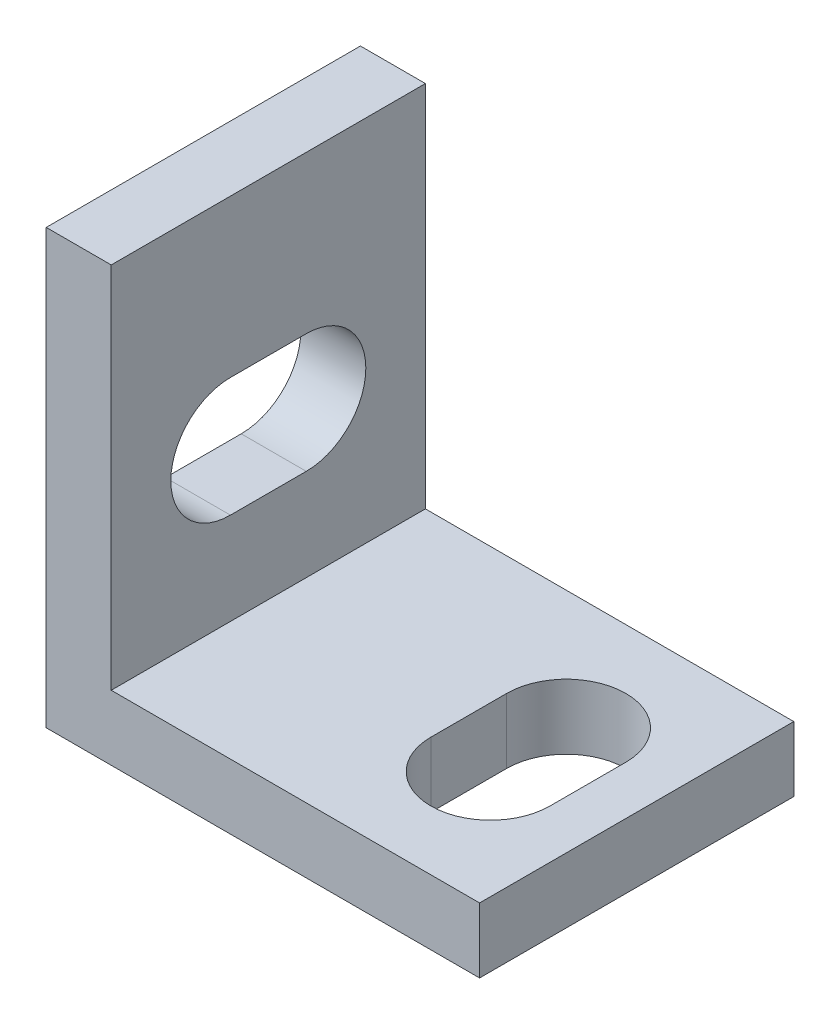
ISO-10303-21;
HEADER;
FILE_DESCRIPTION(('STEP AP214'),'2;1');
FILE_NAME('part.step','',(''),(''),'','','');
FILE_SCHEMA(('AUTOMOTIVE_DESIGN { 1 0 10303 214 1 1 1 1 }'));
ENDSEC;
DATA;
#1=APPLICATION_CONTEXT('core data for automotive mechanical design processes');
#2=APPLICATION_PROTOCOL_DEFINITION('international standard','automotive_design',2000,#1);
#3=PRODUCT_CONTEXT('',#1,'mechanical');
#4=PRODUCT('Part','Part','',(#3));
#5=PRODUCT_RELATED_PRODUCT_CATEGORY('part','',(#4));
#6=PRODUCT_DEFINITION_FORMATION('','',#4);
#7=PRODUCT_DEFINITION_CONTEXT('part definition',#1,'design');
#8=PRODUCT_DEFINITION('design','',#6,#7);
#9=PRODUCT_DEFINITION_SHAPE('','',#8);
#10=(LENGTH_UNIT() NAMED_UNIT(*) SI_UNIT(.MILLI.,.METRE.));
#11=(NAMED_UNIT(*) PLANE_ANGLE_UNIT() SI_UNIT($,.RADIAN.));
#12=(NAMED_UNIT(*) SI_UNIT($,.STERADIAN.) SOLID_ANGLE_UNIT());
#13=UNCERTAINTY_MEASURE_WITH_UNIT(LENGTH_MEASURE(1.E-05),#10,'distance_accuracy_value','');
#14=(GEOMETRIC_REPRESENTATION_CONTEXT(3) GLOBAL_UNCERTAINTY_ASSIGNED_CONTEXT((#13)) GLOBAL_UNIT_ASSIGNED_CONTEXT((#10,
#11,#12)) REPRESENTATION_CONTEXT('',''));
#15=CARTESIAN_POINT('',(0.,0.,0.));
#16=DIRECTION('',(0.,0.,1.));
#17=DIRECTION('',(1.,0.,0.));
#18=AXIS2_PLACEMENT_3D('',#15,#16,#17);
#19=CARTESIAN_POINT('',(0.,0.,14.5));
#20=DIRECTION('',(0.,1.,0.));
#21=DIRECTION('',(0.,0.,1.));
#22=AXIS2_PLACEMENT_3D('',#19,#20,#21);
#23=PLANE('',#22);
#24=DIRECTION('',(0.,0.,1.));
#25=VECTOR('',#24,1.);
#26=CARTESIAN_POINT('',(12.25,0.,9.));
#27=LINE('',#26,#25);
#28=CARTESIAN_POINT('',(12.25,0.,5.5));
#29=VERTEX_POINT('',#28);
#30=CARTESIAN_POINT('',(12.25,0.,9.));
#31=VERTEX_POINT('',#30);
#32=EDGE_CURVE('E141',#29,#31,#27,.T.);
#33=ORIENTED_EDGE('',*,*,#32,.T.);
#34=CARTESIAN_POINT('',(15.,0.,9.));
#35=DIRECTION('',(0.,1.,0.));
#36=DIRECTION('',(0.,0.,1.));
#37=AXIS2_PLACEMENT_3D('',#34,#35,#36);
#38=CIRCLE('',#37,2.75);
#39=CARTESIAN_POINT('',(17.75,0.,9.));
#40=VERTEX_POINT('',#39);
#41=EDGE_CURVE('E135',#31,#40,#38,.T.);
#42=ORIENTED_EDGE('',*,*,#41,.T.);
#43=DIRECTION('',(0.,0.,-1.));
#44=VECTOR('',#43,1.);
#45=CARTESIAN_POINT('',(17.75,0.,9.));
#46=LINE('',#45,#44);
#47=CARTESIAN_POINT('',(17.75,0.,5.5));
#48=VERTEX_POINT('',#47);
#49=EDGE_CURVE('E144',#40,#48,#46,.T.);
#50=ORIENTED_EDGE('',*,*,#49,.T.);
#51=CARTESIAN_POINT('',(15.,0.,5.5));
#52=DIRECTION('',(0.,1.,0.));
#53=DIRECTION('',(0.,0.,1.));
#54=AXIS2_PLACEMENT_3D('',#51,#52,#53);
#55=CIRCLE('',#54,2.75);
#56=EDGE_CURVE('E48',#48,#29,#55,.T.);
#57=ORIENTED_EDGE('',*,*,#56,.T.);
#58=EDGE_LOOP('',(#33,#42,#50,#57));
#59=FACE_BOUND('',#58,.T.);
#60=DIRECTION('',(1.,0.,0.));
#61=VECTOR('',#60,1.);
#62=CARTESIAN_POINT('',(0.,0.,0.));
#63=LINE('',#62,#61);
#64=CARTESIAN_POINT('',(0.,0.,0.));
#65=VERTEX_POINT('',#64);
#66=CARTESIAN_POINT('',(20.,0.,0.));
#67=VERTEX_POINT('',#66);
#68=EDGE_CURVE('E194',#65,#67,#63,.T.);
#69=ORIENTED_EDGE('',*,*,#68,.T.);
#70=DIRECTION('',(0.,0.,-1.));
#71=VECTOR('',#70,1.);
#72=CARTESIAN_POINT('',(20.,0.,14.5));
#73=LINE('',#72,#71);
#74=CARTESIAN_POINT('',(20.,0.,14.5));
#75=VERTEX_POINT('',#74);
#76=EDGE_CURVE('E11',#75,#67,#73,.T.);
#77=ORIENTED_EDGE('',*,*,#76,.F.);
#78=DIRECTION('',(1.,0.,0.));
#79=VECTOR('',#78,1.);
#80=CARTESIAN_POINT('',(0.,0.,14.5));
#81=LINE('',#80,#79);
#82=CARTESIAN_POINT('',(0.,0.,14.5));
#83=VERTEX_POINT('',#82);
#84=EDGE_CURVE('E201',#83,#75,#81,.T.);
#85=ORIENTED_EDGE('',*,*,#84,.F.);
#86=DIRECTION('',(0.,0.,-1.));
#87=VECTOR('',#86,1.);
#88=CARTESIAN_POINT('',(0.,0.,14.5));
#89=LINE('',#88,#87);
#90=EDGE_CURVE('E218',#83,#65,#89,.T.);
#91=ORIENTED_EDGE('',*,*,#90,.T.);
#92=EDGE_LOOP('',(#69,#77,#85,#91));
#93=FACE_BOUND('',#92,.T.);
#94=ADVANCED_FACE('F34',(#59,#93),#23,.F.);
#95=CARTESIAN_POINT('',(20.,3.,14.5));
#96=DIRECTION('',(1.,0.,0.));
#97=DIRECTION('',(0.,0.,-1.));
#98=AXIS2_PLACEMENT_3D('',#95,#96,#97);
#99=PLANE('',#98);
#100=DIRECTION('',(0.,-1.,0.));
#101=VECTOR('',#100,1.);
#102=CARTESIAN_POINT('',(20.,3.,0.));
#103=LINE('',#102,#101);
#104=CARTESIAN_POINT('',(20.,3.,0.));
#105=VERTEX_POINT('',#104);
#106=EDGE_CURVE('E221',#105,#67,#103,.T.);
#107=ORIENTED_EDGE('',*,*,#106,.F.);
#108=DIRECTION('',(0.,0.,-1.));
#109=VECTOR('',#108,1.);
#110=CARTESIAN_POINT('',(20.,3.,14.5));
#111=LINE('',#110,#109);
#112=CARTESIAN_POINT('',(20.,3.,14.5));
#113=VERTEX_POINT('',#112);
#114=EDGE_CURVE('E41',#113,#105,#111,.T.);
#115=ORIENTED_EDGE('',*,*,#114,.F.);
#116=DIRECTION('',(0.,-1.,0.));
#117=VECTOR('',#116,1.);
#118=CARTESIAN_POINT('',(20.,3.,14.5));
#119=LINE('',#118,#117);
#120=EDGE_CURVE('E203',#113,#75,#119,.T.);
#121=ORIENTED_EDGE('',*,*,#120,.T.);
#122=ORIENTED_EDGE('',*,*,#76,.T.);
#123=EDGE_LOOP('',(#107,#115,#121,#122));
#124=FACE_BOUND('',#123,.T.);
#125=ADVANCED_FACE('F248',(#124),#99,.T.);
#126=CARTESIAN_POINT('',(0.,3.,14.5));
#127=DIRECTION('',(0.,1.,0.));
#128=DIRECTION('',(0.,0.,1.));
#129=AXIS2_PLACEMENT_3D('',#126,#127,#128);
#130=PLANE('',#129);
#131=CARTESIAN_POINT('',(15.,3.,9.));
#132=DIRECTION('',(0.,1.,0.));
#133=DIRECTION('',(0.,0.,1.));
#134=AXIS2_PLACEMENT_3D('',#131,#132,#133);
#135=CIRCLE('',#134,2.75);
#136=CARTESIAN_POINT('',(12.25,3.,9.));
#137=VERTEX_POINT('',#136);
#138=CARTESIAN_POINT('',(17.75,3.,9.));
#139=VERTEX_POINT('',#138);
#140=EDGE_CURVE('E56',#137,#139,#135,.T.);
#141=ORIENTED_EDGE('',*,*,#140,.F.);
#142=DIRECTION('',(0.,0.,1.));
#143=VECTOR('',#142,1.);
#144=CARTESIAN_POINT('',(12.25,3.,9.));
#145=LINE('',#144,#143);
#146=CARTESIAN_POINT('',(12.25,3.,5.5));
#147=VERTEX_POINT('',#146);
#148=EDGE_CURVE('E150',#147,#137,#145,.T.);
#149=ORIENTED_EDGE('',*,*,#148,.F.);
#150=CARTESIAN_POINT('',(15.,3.,5.5));
#151=DIRECTION('',(0.,1.,0.));
#152=DIRECTION('',(0.,0.,1.));
#153=AXIS2_PLACEMENT_3D('',#150,#151,#152);
#154=CIRCLE('',#153,2.75);
#155=CARTESIAN_POINT('',(17.75,3.,5.5));
#156=VERTEX_POINT('',#155);
#157=EDGE_CURVE('E153',#156,#147,#154,.T.);
#158=ORIENTED_EDGE('',*,*,#157,.F.);
#159=DIRECTION('',(0.,0.,-1.));
#160=VECTOR('',#159,1.);
#161=CARTESIAN_POINT('',(17.75,3.,9.));
#162=LINE('',#161,#160);
#163=EDGE_CURVE('E159',#139,#156,#162,.T.);
#164=ORIENTED_EDGE('',*,*,#163,.F.);
#165=EDGE_LOOP('',(#141,#149,#158,#164));
#166=FACE_BOUND('',#165,.T.);
#167=DIRECTION('',(1.,0.,0.));
#168=VECTOR('',#167,1.);
#169=CARTESIAN_POINT('',(0.,3.,0.));
#170=LINE('',#169,#168);
#171=CARTESIAN_POINT('',(3.,3.,0.));
#172=VERTEX_POINT('',#171);
#173=EDGE_CURVE('E224',#172,#105,#170,.T.);
#174=ORIENTED_EDGE('',*,*,#173,.F.);
#175=DIRECTION('',(0.,0.,-1.));
#176=VECTOR('',#175,1.);
#177=CARTESIAN_POINT('',(3.,3.,14.5));
#178=LINE('',#177,#176);
#179=CARTESIAN_POINT('',(3.,3.,14.5));
#180=VERTEX_POINT('',#179);
#181=EDGE_CURVE('E240',#180,#172,#178,.T.);
#182=ORIENTED_EDGE('',*,*,#181,.F.);
#183=DIRECTION('',(1.,0.,0.));
#184=VECTOR('',#183,1.);
#185=CARTESIAN_POINT('',(0.,3.,14.5));
#186=LINE('',#185,#184);
#187=EDGE_CURVE('E207',#180,#113,#186,.T.);
#188=ORIENTED_EDGE('',*,*,#187,.T.);
#189=ORIENTED_EDGE('',*,*,#114,.T.);
#190=EDGE_LOOP('',(#174,#182,#188,#189));
#191=FACE_BOUND('',#190,.T.);
#192=ADVANCED_FACE('F244',(#166,#191),#130,.T.);
#193=CARTESIAN_POINT('',(3.,20.,14.5));
#194=DIRECTION('',(1.,0.,0.));
#195=DIRECTION('',(0.,0.,-1.));
#196=AXIS2_PLACEMENT_3D('',#193,#194,#195);
#197=PLANE('',#196);
#198=CARTESIAN_POINT('',(3.,10.,5.5));
#199=DIRECTION('',(1.,0.,0.));
#200=DIRECTION('',(0.,0.,-1.));
#201=AXIS2_PLACEMENT_3D('',#198,#199,#200);
#202=CIRCLE('',#201,2.75);
#203=CARTESIAN_POINT('',(3.,7.25,5.5));
#204=VERTEX_POINT('',#203);
#205=CARTESIAN_POINT('',(3.,12.75,5.5));
#206=VERTEX_POINT('',#205);
#207=EDGE_CURVE('E165',#204,#206,#202,.T.);
#208=ORIENTED_EDGE('',*,*,#207,.F.);
#209=DIRECTION('',(0.,0.,-1.));
#210=VECTOR('',#209,1.);
#211=CARTESIAN_POINT('',(3.,7.25,5.5));
#212=LINE('',#211,#210);
#213=CARTESIAN_POINT('',(3.,7.25,9.));
#214=VERTEX_POINT('',#213);
#215=EDGE_CURVE('E173',#214,#204,#212,.T.);
#216=ORIENTED_EDGE('',*,*,#215,.F.);
#217=CARTESIAN_POINT('',(3.,10.,9.));
#218=DIRECTION('',(1.,0.,0.));
#219=DIRECTION('',(0.,0.,-1.));
#220=AXIS2_PLACEMENT_3D('',#217,#218,#219);
#221=CIRCLE('',#220,2.75);
#222=CARTESIAN_POINT('',(3.,12.75,9.));
#223=VERTEX_POINT('',#222);
#224=EDGE_CURVE('E187',#223,#214,#221,.T.);
#225=ORIENTED_EDGE('',*,*,#224,.F.);
#226=DIRECTION('',(0.,0.,1.));
#227=VECTOR('',#226,1.);
#228=CARTESIAN_POINT('',(3.,12.75,5.5));
#229=LINE('',#228,#227);
#230=EDGE_CURVE('E184',#206,#223,#229,.T.);
#231=ORIENTED_EDGE('',*,*,#230,.F.);
#232=EDGE_LOOP('',(#208,#216,#225,#231));
#233=FACE_BOUND('',#232,.T.);
#234=DIRECTION('',(0.,1.,0.));
#235=VECTOR('',#234,1.);
#236=CARTESIAN_POINT('',(3.,20.,0.));
#237=LINE('',#236,#235);
#238=CARTESIAN_POINT('',(3.,20.,0.));
#239=VERTEX_POINT('',#238);
#240=EDGE_CURVE('E227',#239,#172,#237,.F.);
#241=ORIENTED_EDGE('',*,*,#240,.F.);
#242=DIRECTION('',(0.,0.,-1.));
#243=VECTOR('',#242,1.);
#244=CARTESIAN_POINT('',(3.,20.,14.5));
#245=LINE('',#244,#243);
#246=CARTESIAN_POINT('',(3.,20.,14.5));
#247=VERTEX_POINT('',#246);
#248=EDGE_CURVE('E238',#247,#239,#245,.T.);
#249=ORIENTED_EDGE('',*,*,#248,.F.);
#250=DIRECTION('',(0.,1.,0.));
#251=VECTOR('',#250,1.);
#252=CARTESIAN_POINT('',(3.,20.,14.5));
#253=LINE('',#252,#251);
#254=EDGE_CURVE('E210',#247,#180,#253,.F.);
#255=ORIENTED_EDGE('',*,*,#254,.T.);
#256=ORIENTED_EDGE('',*,*,#181,.T.);
#257=EDGE_LOOP('',(#241,#249,#255,#256));
#258=FACE_BOUND('',#257,.T.);
#259=ADVANCED_FACE('F257',(#233,#258),#197,.T.);
#260=CARTESIAN_POINT('',(0.,20.,14.5));
#261=DIRECTION('',(0.,1.,0.));
#262=DIRECTION('',(0.,0.,1.));
#263=AXIS2_PLACEMENT_3D('',#260,#261,#262);
#264=PLANE('',#263);
#265=DIRECTION('',(1.,0.,0.));
#266=VECTOR('',#265,1.);
#267=CARTESIAN_POINT('',(0.,20.,0.));
#268=LINE('',#267,#266);
#269=CARTESIAN_POINT('',(0.,20.,0.));
#270=VERTEX_POINT('',#269);
#271=EDGE_CURVE('E230',#270,#239,#268,.T.);
#272=ORIENTED_EDGE('',*,*,#271,.F.);
#273=DIRECTION('',(0.,0.,-1.));
#274=VECTOR('',#273,1.);
#275=CARTESIAN_POINT('',(0.,20.,14.5));
#276=LINE('',#275,#274);
#277=CARTESIAN_POINT('',(0.,20.,14.5));
#278=VERTEX_POINT('',#277);
#279=EDGE_CURVE('E236',#278,#270,#276,.T.);
#280=ORIENTED_EDGE('',*,*,#279,.F.);
#281=DIRECTION('',(1.,0.,0.));
#282=VECTOR('',#281,1.);
#283=CARTESIAN_POINT('',(0.,20.,14.5));
#284=LINE('',#283,#282);
#285=EDGE_CURVE('E213',#278,#247,#284,.T.);
#286=ORIENTED_EDGE('',*,*,#285,.T.);
#287=ORIENTED_EDGE('',*,*,#248,.T.);
#288=EDGE_LOOP('',(#272,#280,#286,#287));
#289=FACE_BOUND('',#288,.T.);
#290=ADVANCED_FACE('F267',(#289),#264,.T.);
#291=CARTESIAN_POINT('',(0.,20.,14.5));
#292=DIRECTION('',(1.,0.,0.));
#293=DIRECTION('',(0.,0.,-1.));
#294=AXIS2_PLACEMENT_3D('',#291,#292,#293);
#295=PLANE('',#294);
#296=DIRECTION('',(0.,0.,-1.));
#297=VECTOR('',#296,1.);
#298=CARTESIAN_POINT('',(0.,7.25,5.5));
#299=LINE('',#298,#297);
#300=CARTESIAN_POINT('',(0.,7.25,9.));
#301=VERTEX_POINT('',#300);
#302=CARTESIAN_POINT('',(0.,7.25,5.5));
#303=VERTEX_POINT('',#302);
#304=EDGE_CURVE('E179',#301,#303,#299,.T.);
#305=ORIENTED_EDGE('',*,*,#304,.T.);
#306=CARTESIAN_POINT('',(0.,10.,5.5));
#307=DIRECTION('',(1.,0.,0.));
#308=DIRECTION('',(0.,0.,-1.));
#309=AXIS2_PLACEMENT_3D('',#306,#307,#308);
#310=CIRCLE('',#309,2.75);
#311=CARTESIAN_POINT('',(0.,12.75,5.5));
#312=VERTEX_POINT('',#311);
#313=EDGE_CURVE('E169',#303,#312,#310,.T.);
#314=ORIENTED_EDGE('',*,*,#313,.T.);
#315=DIRECTION('',(0.,0.,1.));
#316=VECTOR('',#315,1.);
#317=CARTESIAN_POINT('',(0.,12.75,5.5));
#318=LINE('',#317,#316);
#319=CARTESIAN_POINT('',(0.,12.75,9.));
#320=VERTEX_POINT('',#319);
#321=EDGE_CURVE('E172',#312,#320,#318,.T.);
#322=ORIENTED_EDGE('',*,*,#321,.T.);
#323=CARTESIAN_POINT('',(0.,10.,9.));
#324=DIRECTION('',(1.,0.,0.));
#325=DIRECTION('',(0.,0.,-1.));
#326=AXIS2_PLACEMENT_3D('',#323,#324,#325);
#327=CIRCLE('',#326,2.75);
#328=EDGE_CURVE('E176',#320,#301,#327,.T.);
#329=ORIENTED_EDGE('',*,*,#328,.T.);
#330=EDGE_LOOP('',(#305,#314,#322,#329));
#331=FACE_BOUND('',#330,.T.);
#332=DIRECTION('',(0.,-1.,0.));
#333=VECTOR('',#332,1.);
#334=CARTESIAN_POINT('',(0.,20.,0.));
#335=LINE('',#334,#333);
#336=EDGE_CURVE('E204',#270,#65,#335,.T.);
#337=ORIENTED_EDGE('',*,*,#336,.T.);
#338=ORIENTED_EDGE('',*,*,#90,.F.);
#339=DIRECTION('',(0.,-1.,0.));
#340=VECTOR('',#339,1.);
#341=CARTESIAN_POINT('',(0.,20.,14.5));
#342=LINE('',#341,#340);
#343=EDGE_CURVE('E216',#278,#83,#342,.T.);
#344=ORIENTED_EDGE('',*,*,#343,.F.);
#345=ORIENTED_EDGE('',*,*,#279,.T.);
#346=EDGE_LOOP('',(#337,#338,#344,#345));
#347=FACE_BOUND('',#346,.T.);
#348=ADVANCED_FACE('F268',(#331,#347),#295,.F.);
#349=CARTESIAN_POINT('',(0.,0.,14.5));
#350=DIRECTION('',(0.,0.,-1.));
#351=DIRECTION('',(-1.,0.,0.));
#352=AXIS2_PLACEMENT_3D('',#349,#350,#351);
#353=PLANE('',#352);
#354=ORIENTED_EDGE('',*,*,#84,.T.);
#355=ORIENTED_EDGE('',*,*,#120,.F.);
#356=ORIENTED_EDGE('',*,*,#187,.F.);
#357=ORIENTED_EDGE('',*,*,#254,.F.);
#358=ORIENTED_EDGE('',*,*,#285,.F.);
#359=ORIENTED_EDGE('',*,*,#343,.T.);
#360=EDGE_LOOP('',(#354,#355,#356,#357,#358,#359));
#361=FACE_BOUND('',#360,.T.);
#362=ADVANCED_FACE('F260',(#361),#353,.F.);
#363=CARTESIAN_POINT('',(0.,0.,0.));
#364=DIRECTION('',(0.,0.,-1.));
#365=DIRECTION('',(-1.,0.,0.));
#366=AXIS2_PLACEMENT_3D('',#363,#364,#365);
#367=PLANE('',#366);
#368=ORIENTED_EDGE('',*,*,#68,.F.);
#369=ORIENTED_EDGE('',*,*,#336,.F.);
#370=ORIENTED_EDGE('',*,*,#271,.T.);
#371=ORIENTED_EDGE('',*,*,#240,.T.);
#372=ORIENTED_EDGE('',*,*,#173,.T.);
#373=ORIENTED_EDGE('',*,*,#106,.T.);
#374=EDGE_LOOP('',(#368,#369,#370,#371,#372,#373));
#375=FACE_BOUND('',#374,.T.);
#376=ADVANCED_FACE('F252',(#375),#367,.T.);
#377=CARTESIAN_POINT('',(0.,10.,5.5));
#378=DIRECTION('',(1.,0.,0.));
#379=DIRECTION('',(0.,0.,-1.));
#380=AXIS2_PLACEMENT_3D('',#377,#378,#379);
#381=CYLINDRICAL_SURFACE('',#380,2.75);
#382=ORIENTED_EDGE('',*,*,#207,.T.);
#383=DIRECTION('',(1.,0.,0.));
#384=VECTOR('',#383,1.);
#385=CARTESIAN_POINT('',(0.,12.75,5.5));
#386=LINE('',#385,#384);
#387=EDGE_CURVE('E182',#312,#206,#386,.T.);
#388=ORIENTED_EDGE('',*,*,#387,.F.);
#389=ORIENTED_EDGE('',*,*,#313,.F.);
#390=DIRECTION('',(1.,0.,0.));
#391=VECTOR('',#390,1.);
#392=CARTESIAN_POINT('',(0.,7.25,5.5));
#393=LINE('',#392,#391);
#394=EDGE_CURVE('E192',#303,#204,#393,.T.);
#395=ORIENTED_EDGE('',*,*,#394,.T.);
#396=EDGE_LOOP('',(#382,#388,#389,#395));
#397=FACE_BOUND('',#396,.T.);
#398=ADVANCED_FACE('F298',(#397),#381,.F.);
#399=CARTESIAN_POINT('',(0.,7.25,5.5));
#400=DIRECTION('',(0.,-1.,0.));
#401=DIRECTION('',(0.,0.,-1.));
#402=AXIS2_PLACEMENT_3D('',#399,#400,#401);
#403=PLANE('',#402);
#404=ORIENTED_EDGE('',*,*,#215,.T.);
#405=ORIENTED_EDGE('',*,*,#394,.F.);
#406=ORIENTED_EDGE('',*,*,#304,.F.);
#407=DIRECTION('',(1.,0.,0.));
#408=VECTOR('',#407,1.);
#409=CARTESIAN_POINT('',(0.,7.25,9.));
#410=LINE('',#409,#408);
#411=EDGE_CURVE('E195',#301,#214,#410,.T.);
#412=ORIENTED_EDGE('',*,*,#411,.T.);
#413=EDGE_LOOP('',(#404,#405,#406,#412));
#414=FACE_BOUND('',#413,.T.);
#415=ADVANCED_FACE('F306',(#414),#403,.F.);
#416=CARTESIAN_POINT('',(0.,10.,9.));
#417=DIRECTION('',(1.,0.,0.));
#418=DIRECTION('',(0.,0.,-1.));
#419=AXIS2_PLACEMENT_3D('',#416,#417,#418);
#420=CYLINDRICAL_SURFACE('',#419,2.75);
#421=ORIENTED_EDGE('',*,*,#224,.T.);
#422=ORIENTED_EDGE('',*,*,#411,.F.);
#423=ORIENTED_EDGE('',*,*,#328,.F.);
#424=DIRECTION('',(1.,0.,0.));
#425=VECTOR('',#424,1.);
#426=CARTESIAN_POINT('',(0.,12.75,9.));
#427=LINE('',#426,#425);
#428=EDGE_CURVE('E197',#320,#223,#427,.T.);
#429=ORIENTED_EDGE('',*,*,#428,.T.);
#430=EDGE_LOOP('',(#421,#422,#423,#429));
#431=FACE_BOUND('',#430,.T.);
#432=ADVANCED_FACE('F308',(#431),#420,.F.);
#433=CARTESIAN_POINT('',(0.,12.75,5.5));
#434=DIRECTION('',(0.,1.,0.));
#435=DIRECTION('',(0.,0.,1.));
#436=AXIS2_PLACEMENT_3D('',#433,#434,#435);
#437=PLANE('',#436);
#438=ORIENTED_EDGE('',*,*,#230,.T.);
#439=ORIENTED_EDGE('',*,*,#428,.F.);
#440=ORIENTED_EDGE('',*,*,#321,.F.);
#441=ORIENTED_EDGE('',*,*,#387,.T.);
#442=EDGE_LOOP('',(#438,#439,#440,#441));
#443=FACE_BOUND('',#442,.T.);
#444=ADVANCED_FACE('F302',(#443),#437,.F.);
#445=CARTESIAN_POINT('',(15.,0.,9.));
#446=DIRECTION('',(0.,1.,0.));
#447=DIRECTION('',(0.,0.,1.));
#448=AXIS2_PLACEMENT_3D('',#445,#446,#447);
#449=CYLINDRICAL_SURFACE('',#448,2.75);
#450=ORIENTED_EDGE('',*,*,#140,.T.);
#451=DIRECTION('',(0.,1.,0.));
#452=VECTOR('',#451,1.);
#453=CARTESIAN_POINT('',(17.75,0.,9.));
#454=LINE('',#453,#452);
#455=EDGE_CURVE('E131',#40,#139,#454,.T.);
#456=ORIENTED_EDGE('',*,*,#455,.F.);
#457=ORIENTED_EDGE('',*,*,#41,.F.);
#458=DIRECTION('',(0.,1.,0.));
#459=VECTOR('',#458,1.);
#460=CARTESIAN_POINT('',(12.25,0.,9.));
#461=LINE('',#460,#459);
#462=EDGE_CURVE('E163',#31,#137,#461,.T.);
#463=ORIENTED_EDGE('',*,*,#462,.T.);
#464=EDGE_LOOP('',(#450,#456,#457,#463));
#465=FACE_BOUND('',#464,.T.);
#466=ADVANCED_FACE('F133',(#465),#449,.F.);
#467=CARTESIAN_POINT('',(12.25,0.,9.));
#468=DIRECTION('',(-1.,0.,0.));
#469=DIRECTION('',(0.,0.,1.));
#470=AXIS2_PLACEMENT_3D('',#467,#468,#469);
#471=PLANE('',#470);
#472=ORIENTED_EDGE('',*,*,#148,.T.);
#473=ORIENTED_EDGE('',*,*,#462,.F.);
#474=ORIENTED_EDGE('',*,*,#32,.F.);
#475=DIRECTION('',(0.,1.,0.));
#476=VECTOR('',#475,1.);
#477=CARTESIAN_POINT('',(12.25,0.,5.5));
#478=LINE('',#477,#476);
#479=EDGE_CURVE('E166',#29,#147,#478,.T.);
#480=ORIENTED_EDGE('',*,*,#479,.T.);
#481=EDGE_LOOP('',(#472,#473,#474,#480));
#482=FACE_BOUND('',#481,.T.);
#483=ADVANCED_FACE('F364',(#482),#471,.F.);
#484=CARTESIAN_POINT('',(15.,0.,5.5));
#485=DIRECTION('',(0.,1.,0.));
#486=DIRECTION('',(0.,0.,1.));
#487=AXIS2_PLACEMENT_3D('',#484,#485,#486);
#488=CYLINDRICAL_SURFACE('',#487,2.75);
#489=ORIENTED_EDGE('',*,*,#157,.T.);
#490=ORIENTED_EDGE('',*,*,#479,.F.);
#491=ORIENTED_EDGE('',*,*,#56,.F.);
#492=DIRECTION('',(0.,1.,0.));
#493=VECTOR('',#492,1.);
#494=CARTESIAN_POINT('',(17.75,0.,5.5));
#495=LINE('',#494,#493);
#496=EDGE_CURVE('E140',#48,#156,#495,.T.);
#497=ORIENTED_EDGE('',*,*,#496,.T.);
#498=EDGE_LOOP('',(#489,#490,#491,#497));
#499=FACE_BOUND('',#498,.T.);
#500=ADVANCED_FACE('F372',(#499),#488,.F.);
#501=CARTESIAN_POINT('',(17.75,0.,9.));
#502=DIRECTION('',(1.,0.,0.));
#503=DIRECTION('',(0.,0.,-1.));
#504=AXIS2_PLACEMENT_3D('',#501,#502,#503);
#505=PLANE('',#504);
#506=ORIENTED_EDGE('',*,*,#163,.T.);
#507=ORIENTED_EDGE('',*,*,#496,.F.);
#508=ORIENTED_EDGE('',*,*,#49,.F.);
#509=ORIENTED_EDGE('',*,*,#455,.T.);
#510=EDGE_LOOP('',(#506,#507,#508,#509));
#511=FACE_BOUND('',#510,.T.);
#512=ADVANCED_FACE('F145',(#511),#505,.F.);
#513=CLOSED_SHELL('',(#94,#125,#192,#259,#290,#348,#362,#376,#398,#415,#432,#444,#466,#483,#500,#512));
#514=MANIFOLD_SOLID_BREP('B2',#513);
#515=ADVANCED_BREP_SHAPE_REPRESENTATION('',(#18,#514),#14);
#516=SHAPE_DEFINITION_REPRESENTATION(#9,#515);
ENDSEC;
END-ISO-10303-21;
